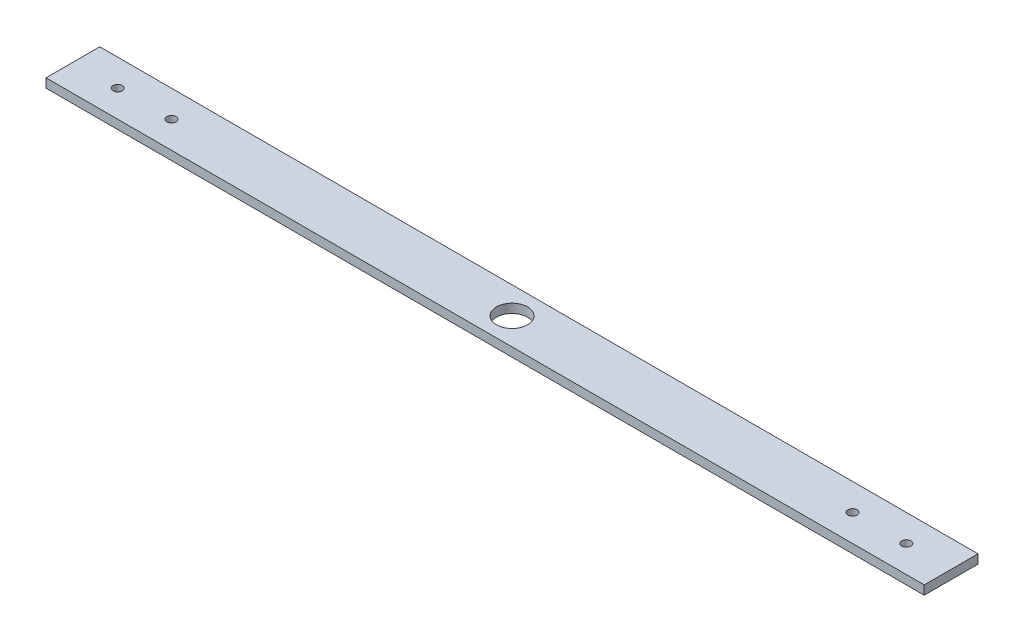
ISO-10303-21;
HEADER;
FILE_DESCRIPTION(('STEP AP214'),'2;1');
FILE_NAME('part.step','',(''),(''),'','','');
FILE_SCHEMA(('AUTOMOTIVE_DESIGN { 1 0 10303 214 1 1 1 1 }'));
ENDSEC;
DATA;
#1=APPLICATION_CONTEXT('core data for automotive mechanical design processes');
#2=APPLICATION_PROTOCOL_DEFINITION('international standard','automotive_design',2000,#1);
#3=PRODUCT_CONTEXT('',#1,'mechanical');
#4=PRODUCT('Part','Part','',(#3));
#5=PRODUCT_RELATED_PRODUCT_CATEGORY('part','',(#4));
#6=PRODUCT_DEFINITION_FORMATION('','',#4);
#7=PRODUCT_DEFINITION_CONTEXT('part definition',#1,'design');
#8=PRODUCT_DEFINITION('design','',#6,#7);
#9=PRODUCT_DEFINITION_SHAPE('','',#8);
#10=(LENGTH_UNIT() NAMED_UNIT(*) SI_UNIT(.MILLI.,.METRE.));
#11=(NAMED_UNIT(*) PLANE_ANGLE_UNIT() SI_UNIT($,.RADIAN.));
#12=(NAMED_UNIT(*) SI_UNIT($,.STERADIAN.) SOLID_ANGLE_UNIT());
#13=UNCERTAINTY_MEASURE_WITH_UNIT(LENGTH_MEASURE(1.E-05),#10,'distance_accuracy_value','');
#14=(GEOMETRIC_REPRESENTATION_CONTEXT(3) GLOBAL_UNCERTAINTY_ASSIGNED_CONTEXT((#13)) GLOBAL_UNIT_ASSIGNED_CONTEXT((#10,
#11,#12)) REPRESENTATION_CONTEXT('',''));
#15=CARTESIAN_POINT('',(0.,0.,0.));
#16=DIRECTION('',(0.,0.,1.));
#17=DIRECTION('',(1.,0.,0.));
#18=AXIS2_PLACEMENT_3D('',#15,#16,#17);
#19=CARTESIAN_POINT('',(311.15,6.35,-19.05));
#20=DIRECTION('',(-1.,0.,0.));
#21=DIRECTION('',(0.,0.,1.));
#22=AXIS2_PLACEMENT_3D('',#19,#20,#21);
#23=PLANE('',#22);
#24=DIRECTION('',(0.,0.,-1.));
#25=VECTOR('',#24,1.);
#26=CARTESIAN_POINT('',(311.15,0.,-19.05));
#27=LINE('',#26,#25);
#28=CARTESIAN_POINT('',(311.15,0.,19.05));
#29=VERTEX_POINT('',#28);
#30=CARTESIAN_POINT('',(311.15,0.,-19.05));
#31=VERTEX_POINT('',#30);
#32=EDGE_CURVE('E111',#29,#31,#27,.T.);
#33=ORIENTED_EDGE('',*,*,#32,.T.);
#34=DIRECTION('',(0.,-1.,0.));
#35=VECTOR('',#34,1.);
#36=CARTESIAN_POINT('',(311.15,6.35,-19.05));
#37=LINE('',#36,#35);
#38=CARTESIAN_POINT('',(311.15,6.35,-19.05));
#39=VERTEX_POINT('',#38);
#40=EDGE_CURVE('E11',#39,#31,#37,.T.);
#41=ORIENTED_EDGE('',*,*,#40,.F.);
#42=DIRECTION('',(0.,0.,-1.));
#43=VECTOR('',#42,1.);
#44=CARTESIAN_POINT('',(311.15,6.35,-19.05));
#45=LINE('',#44,#43);
#46=CARTESIAN_POINT('',(311.15,6.35,19.05));
#47=VERTEX_POINT('',#46);
#48=EDGE_CURVE('E93',#47,#39,#45,.T.);
#49=ORIENTED_EDGE('',*,*,#48,.F.);
#50=DIRECTION('',(0.,-1.,0.));
#51=VECTOR('',#50,1.);
#52=CARTESIAN_POINT('',(311.15,6.35,19.05));
#53=LINE('',#52,#51);
#54=EDGE_CURVE('E107',#47,#29,#53,.T.);
#55=ORIENTED_EDGE('',*,*,#54,.T.);
#56=EDGE_LOOP('',(#33,#41,#49,#55));
#57=FACE_BOUND('',#56,.T.);
#58=ADVANCED_FACE('F40',(#57),#23,.F.);
#59=CARTESIAN_POINT('',(-311.15,6.35,-19.05));
#60=DIRECTION('',(0.,0.,1.));
#61=DIRECTION('',(1.,0.,0.));
#62=AXIS2_PLACEMENT_3D('',#59,#60,#61);
#63=PLANE('',#62);
#64=DIRECTION('',(-1.,0.,0.));
#65=VECTOR('',#64,1.);
#66=CARTESIAN_POINT('',(-311.15,0.,-19.05));
#67=LINE('',#66,#65);
#68=CARTESIAN_POINT('',(-311.15,0.,-19.05));
#69=VERTEX_POINT('',#68);
#70=EDGE_CURVE('E98',#31,#69,#67,.T.);
#71=ORIENTED_EDGE('',*,*,#70,.T.);
#72=DIRECTION('',(0.,-1.,0.));
#73=VECTOR('',#72,1.);
#74=CARTESIAN_POINT('',(-311.15,6.35,-19.05));
#75=LINE('',#74,#73);
#76=CARTESIAN_POINT('',(-311.15,6.35,-19.05));
#77=VERTEX_POINT('',#76);
#78=EDGE_CURVE('E50',#77,#69,#75,.T.);
#79=ORIENTED_EDGE('',*,*,#78,.F.);
#80=DIRECTION('',(-1.,0.,0.));
#81=VECTOR('',#80,1.);
#82=CARTESIAN_POINT('',(-311.15,6.35,-19.05));
#83=LINE('',#82,#81);
#84=EDGE_CURVE('E88',#39,#77,#83,.T.);
#85=ORIENTED_EDGE('',*,*,#84,.F.);
#86=ORIENTED_EDGE('',*,*,#40,.T.);
#87=EDGE_LOOP('',(#71,#79,#85,#86));
#88=FACE_BOUND('',#87,.T.);
#89=ADVANCED_FACE('F97',(#88),#63,.F.);
#90=CARTESIAN_POINT('',(-311.15,6.35,-19.05));
#91=DIRECTION('',(1.,0.,0.));
#92=DIRECTION('',(0.,0.,-1.));
#93=AXIS2_PLACEMENT_3D('',#90,#91,#92);
#94=PLANE('',#93);
#95=DIRECTION('',(0.,0.,1.));
#96=VECTOR('',#95,1.);
#97=CARTESIAN_POINT('',(-311.15,0.,-19.05));
#98=LINE('',#97,#96);
#99=CARTESIAN_POINT('',(-311.15,0.,19.05));
#100=VERTEX_POINT('',#99);
#101=EDGE_CURVE('E75',#69,#100,#98,.T.);
#102=ORIENTED_EDGE('',*,*,#101,.T.);
#103=DIRECTION('',(0.,-1.,0.));
#104=VECTOR('',#103,1.);
#105=CARTESIAN_POINT('',(-311.15,6.35,19.05));
#106=LINE('',#105,#104);
#107=CARTESIAN_POINT('',(-311.15,6.35,19.05));
#108=VERTEX_POINT('',#107);
#109=EDGE_CURVE('E100',#108,#100,#106,.T.);
#110=ORIENTED_EDGE('',*,*,#109,.F.);
#111=DIRECTION('',(0.,0.,1.));
#112=VECTOR('',#111,1.);
#113=CARTESIAN_POINT('',(-311.15,6.35,-19.05));
#114=LINE('',#113,#112);
#115=EDGE_CURVE('E91',#77,#108,#114,.T.);
#116=ORIENTED_EDGE('',*,*,#115,.F.);
#117=ORIENTED_EDGE('',*,*,#78,.T.);
#118=EDGE_LOOP('',(#102,#110,#116,#117));
#119=FACE_BOUND('',#118,.T.);
#120=ADVANCED_FACE('F102',(#119),#94,.F.);
#121=CARTESIAN_POINT('',(-311.15,6.35,19.05));
#122=DIRECTION('',(0.,0.,-1.));
#123=DIRECTION('',(-1.,0.,0.));
#124=AXIS2_PLACEMENT_3D('',#121,#122,#123);
#125=PLANE('',#124);
#126=DIRECTION('',(1.,0.,0.));
#127=VECTOR('',#126,1.);
#128=CARTESIAN_POINT('',(-311.15,0.,19.05));
#129=LINE('',#128,#127);
#130=EDGE_CURVE('E81',#100,#29,#129,.T.);
#131=ORIENTED_EDGE('',*,*,#130,.T.);
#132=ORIENTED_EDGE('',*,*,#54,.F.);
#133=DIRECTION('',(1.,0.,0.));
#134=VECTOR('',#133,1.);
#135=CARTESIAN_POINT('',(-311.15,6.35,19.05));
#136=LINE('',#135,#134);
#137=EDGE_CURVE('E58',#108,#47,#136,.T.);
#138=ORIENTED_EDGE('',*,*,#137,.F.);
#139=ORIENTED_EDGE('',*,*,#109,.T.);
#140=EDGE_LOOP('',(#131,#132,#138,#139));
#141=FACE_BOUND('',#140,.T.);
#142=ADVANCED_FACE('F126',(#141),#125,.F.);
#143=CARTESIAN_POINT('',(0.,6.35,0.));
#144=DIRECTION('',(0.,1.,0.));
#145=DIRECTION('',(0.,0.,1.));
#146=AXIS2_PLACEMENT_3D('',#143,#144,#145);
#147=PLANE('',#146);
#148=CARTESIAN_POINT('',(241.3,6.35,0.));
#149=DIRECTION('',(0.,1.,0.));
#150=DIRECTION('',(0.,0.,1.));
#151=AXIS2_PLACEMENT_3D('',#148,#149,#150);
#152=CIRCLE('',#151,3.26389999999999);
#153=CARTESIAN_POINT('',(241.3,6.35,3.26390000000002));
#154=VERTEX_POINT('',#153);
#155=EDGE_CURVE('E165',#154,#154,#152,.T.);
#156=ORIENTED_EDGE('',*,*,#155,.F.);
#157=EDGE_LOOP('',(#156));
#158=FACE_BOUND('',#157,.T.);
#159=CARTESIAN_POINT('',(279.4,6.35,0.));
#160=DIRECTION('',(0.,1.,0.));
#161=DIRECTION('',(0.,0.,1.));
#162=AXIS2_PLACEMENT_3D('',#159,#160,#161);
#163=CIRCLE('',#162,3.26389999999999);
#164=CARTESIAN_POINT('',(279.4,6.35,3.26390000000002));
#165=VERTEX_POINT('',#164);
#166=EDGE_CURVE('E157',#165,#165,#163,.T.);
#167=ORIENTED_EDGE('',*,*,#166,.F.);
#168=EDGE_LOOP('',(#167));
#169=FACE_BOUND('',#168,.T.);
#170=CARTESIAN_POINT('',(-241.3,6.35,0.));
#171=DIRECTION('',(0.,1.,0.));
#172=DIRECTION('',(0.,0.,1.));
#173=AXIS2_PLACEMENT_3D('',#170,#171,#172);
#174=CIRCLE('',#173,3.26389999999999);
#175=CARTESIAN_POINT('',(-241.3,6.35,3.26390000000002));
#176=VERTEX_POINT('',#175);
#177=EDGE_CURVE('E149',#176,#176,#174,.T.);
#178=ORIENTED_EDGE('',*,*,#177,.F.);
#179=EDGE_LOOP('',(#178));
#180=FACE_BOUND('',#179,.T.);
#181=CARTESIAN_POINT('',(-279.4,6.35,0.));
#182=DIRECTION('',(0.,1.,0.));
#183=DIRECTION('',(0.,0.,1.));
#184=AXIS2_PLACEMENT_3D('',#181,#182,#183);
#185=CIRCLE('',#184,3.26389999999999);
#186=CARTESIAN_POINT('',(-279.4,6.35,3.26390000000002));
#187=VERTEX_POINT('',#186);
#188=EDGE_CURVE('E141',#187,#187,#185,.T.);
#189=ORIENTED_EDGE('',*,*,#188,.F.);
#190=EDGE_LOOP('',(#189));
#191=FACE_BOUND('',#190,.T.);
#192=CARTESIAN_POINT('',(0.,6.35,0.));
#193=DIRECTION('',(0.,1.,0.));
#194=DIRECTION('',(0.,0.,1.));
#195=AXIS2_PLACEMENT_3D('',#192,#193,#194);
#196=CIRCLE('',#195,11.);
#197=CARTESIAN_POINT('',(0.,6.35,11.));
#198=VERTEX_POINT('',#197);
#199=EDGE_CURVE('E115',#198,#198,#196,.F.);
#200=ORIENTED_EDGE('',*,*,#199,.T.);
#201=EDGE_LOOP('',(#200));
#202=FACE_BOUND('',#201,.T.);
#203=ORIENTED_EDGE('',*,*,#48,.T.);
#204=ORIENTED_EDGE('',*,*,#84,.T.);
#205=ORIENTED_EDGE('',*,*,#115,.T.);
#206=ORIENTED_EDGE('',*,*,#137,.T.);
#207=EDGE_LOOP('',(#203,#204,#205,#206));
#208=FACE_BOUND('',#207,.T.);
#209=ADVANCED_FACE('F89',(#158,#169,#180,#191,#202,#208),#147,.T.);
#210=CARTESIAN_POINT('',(0.,0.,0.));
#211=DIRECTION('',(0.,1.,0.));
#212=DIRECTION('',(0.,0.,1.));
#213=AXIS2_PLACEMENT_3D('',#210,#211,#212);
#214=PLANE('',#213);
#215=CARTESIAN_POINT('',(241.3,0.,0.));
#216=DIRECTION('',(0.,1.,0.));
#217=DIRECTION('',(0.,0.,1.));
#218=AXIS2_PLACEMENT_3D('',#215,#216,#217);
#219=CIRCLE('',#218,3.26389999999999);
#220=CARTESIAN_POINT('',(241.3,0.,3.26390000000002));
#221=VERTEX_POINT('',#220);
#222=EDGE_CURVE('E161',#221,#221,#219,.T.);
#223=ORIENTED_EDGE('',*,*,#222,.T.);
#224=EDGE_LOOP('',(#223));
#225=FACE_BOUND('',#224,.T.);
#226=CARTESIAN_POINT('',(279.4,0.,0.));
#227=DIRECTION('',(0.,1.,0.));
#228=DIRECTION('',(0.,0.,1.));
#229=AXIS2_PLACEMENT_3D('',#226,#227,#228);
#230=CIRCLE('',#229,3.26389999999999);
#231=CARTESIAN_POINT('',(279.4,0.,3.26390000000002));
#232=VERTEX_POINT('',#231);
#233=EDGE_CURVE('E153',#232,#232,#230,.T.);
#234=ORIENTED_EDGE('',*,*,#233,.T.);
#235=EDGE_LOOP('',(#234));
#236=FACE_BOUND('',#235,.T.);
#237=CARTESIAN_POINT('',(-241.3,0.,0.));
#238=DIRECTION('',(0.,1.,0.));
#239=DIRECTION('',(0.,0.,1.));
#240=AXIS2_PLACEMENT_3D('',#237,#238,#239);
#241=CIRCLE('',#240,3.26389999999999);
#242=CARTESIAN_POINT('',(-241.3,0.,3.26390000000002));
#243=VERTEX_POINT('',#242);
#244=EDGE_CURVE('E145',#243,#243,#241,.T.);
#245=ORIENTED_EDGE('',*,*,#244,.T.);
#246=EDGE_LOOP('',(#245));
#247=FACE_BOUND('',#246,.T.);
#248=CARTESIAN_POINT('',(-279.4,0.,0.));
#249=DIRECTION('',(0.,1.,0.));
#250=DIRECTION('',(0.,0.,1.));
#251=AXIS2_PLACEMENT_3D('',#248,#249,#250);
#252=CIRCLE('',#251,3.26389999999999);
#253=CARTESIAN_POINT('',(-279.4,0.,3.26390000000002));
#254=VERTEX_POINT('',#253);
#255=EDGE_CURVE('E137',#254,#254,#252,.T.);
#256=ORIENTED_EDGE('',*,*,#255,.T.);
#257=EDGE_LOOP('',(#256));
#258=FACE_BOUND('',#257,.T.);
#259=CARTESIAN_POINT('',(0.,0.,0.));
#260=DIRECTION('',(0.,1.,0.));
#261=DIRECTION('',(0.,0.,1.));
#262=AXIS2_PLACEMENT_3D('',#259,#260,#261);
#263=CIRCLE('',#262,11.);
#264=CARTESIAN_POINT('',(0.,0.,11.));
#265=VERTEX_POINT('',#264);
#266=EDGE_CURVE('E43',#265,#265,#263,.F.);
#267=ORIENTED_EDGE('',*,*,#266,.F.);
#268=EDGE_LOOP('',(#267));
#269=FACE_BOUND('',#268,.T.);
#270=ORIENTED_EDGE('',*,*,#32,.F.);
#271=ORIENTED_EDGE('',*,*,#130,.F.);
#272=ORIENTED_EDGE('',*,*,#101,.F.);
#273=ORIENTED_EDGE('',*,*,#70,.F.);
#274=EDGE_LOOP('',(#270,#271,#272,#273));
#275=FACE_BOUND('',#274,.T.);
#276=ADVANCED_FACE('F129',(#225,#236,#247,#258,#269,#275),#214,.F.);
#277=CARTESIAN_POINT('',(0.,6.350012,0.));
#278=DIRECTION('',(0.,-1.,0.));
#279=DIRECTION('',(0.,0.,-1.));
#280=AXIS2_PLACEMENT_3D('',#277,#278,#279);
#281=CYLINDRICAL_SURFACE('',#280,11.);
#282=ORIENTED_EDGE('',*,*,#199,.F.);
#283=EDGE_LOOP('',(#282));
#284=FACE_BOUND('',#283,.T.);
#285=ORIENTED_EDGE('',*,*,#266,.T.);
#286=EDGE_LOOP('',(#285));
#287=FACE_BOUND('',#286,.T.);
#288=ADVANCED_FACE('F184',(#284,#287),#281,.F.);
#289=CARTESIAN_POINT('',(-279.4,6.35,0.));
#290=DIRECTION('',(0.,1.,0.));
#291=DIRECTION('',(0.,0.,1.));
#292=AXIS2_PLACEMENT_3D('',#289,#290,#291);
#293=CYLINDRICAL_SURFACE('',#292,3.26389999999999);
#294=ORIENTED_EDGE('',*,*,#255,.F.);
#295=EDGE_LOOP('',(#294));
#296=FACE_BOUND('',#295,.T.);
#297=ORIENTED_EDGE('',*,*,#188,.T.);
#298=EDGE_LOOP('',(#297));
#299=FACE_BOUND('',#298,.T.);
#300=ADVANCED_FACE('F187',(#296,#299),#293,.F.);
#301=CARTESIAN_POINT('',(-241.3,6.35,0.));
#302=DIRECTION('',(0.,1.,0.));
#303=DIRECTION('',(0.,0.,1.));
#304=AXIS2_PLACEMENT_3D('',#301,#302,#303);
#305=CYLINDRICAL_SURFACE('',#304,3.26389999999999);
#306=ORIENTED_EDGE('',*,*,#244,.F.);
#307=EDGE_LOOP('',(#306));
#308=FACE_BOUND('',#307,.T.);
#309=ORIENTED_EDGE('',*,*,#177,.T.);
#310=EDGE_LOOP('',(#309));
#311=FACE_BOUND('',#310,.T.);
#312=ADVANCED_FACE('F251',(#308,#311),#305,.F.);
#313=CARTESIAN_POINT('',(279.4,6.35,0.));
#314=DIRECTION('',(0.,1.,0.));
#315=DIRECTION('',(0.,0.,1.));
#316=AXIS2_PLACEMENT_3D('',#313,#314,#315);
#317=CYLINDRICAL_SURFACE('',#316,3.26389999999999);
#318=ORIENTED_EDGE('',*,*,#233,.F.);
#319=EDGE_LOOP('',(#318));
#320=FACE_BOUND('',#319,.T.);
#321=ORIENTED_EDGE('',*,*,#166,.T.);
#322=EDGE_LOOP('',(#321));
#323=FACE_BOUND('',#322,.T.);
#324=ADVANCED_FACE('F260',(#320,#323),#317,.F.);
#325=CARTESIAN_POINT('',(241.3,6.35,0.));
#326=DIRECTION('',(0.,1.,0.));
#327=DIRECTION('',(0.,0.,1.));
#328=AXIS2_PLACEMENT_3D('',#325,#326,#327);
#329=CYLINDRICAL_SURFACE('',#328,3.26389999999999);
#330=ORIENTED_EDGE('',*,*,#222,.F.);
#331=EDGE_LOOP('',(#330));
#332=FACE_BOUND('',#331,.T.);
#333=ORIENTED_EDGE('',*,*,#155,.T.);
#334=EDGE_LOOP('',(#333));
#335=FACE_BOUND('',#334,.T.);
#336=ADVANCED_FACE('F171',(#332,#335),#329,.F.);
#337=CLOSED_SHELL('',(#58,#89,#120,#142,#209,#276,#288,#300,#312,#324,#336));
#338=MANIFOLD_SOLID_BREP('B2',#337);
#339=ADVANCED_BREP_SHAPE_REPRESENTATION('',(#18,#338),#14);
#340=SHAPE_DEFINITION_REPRESENTATION(#9,#339);
ENDSEC;
END-ISO-10303-21;
